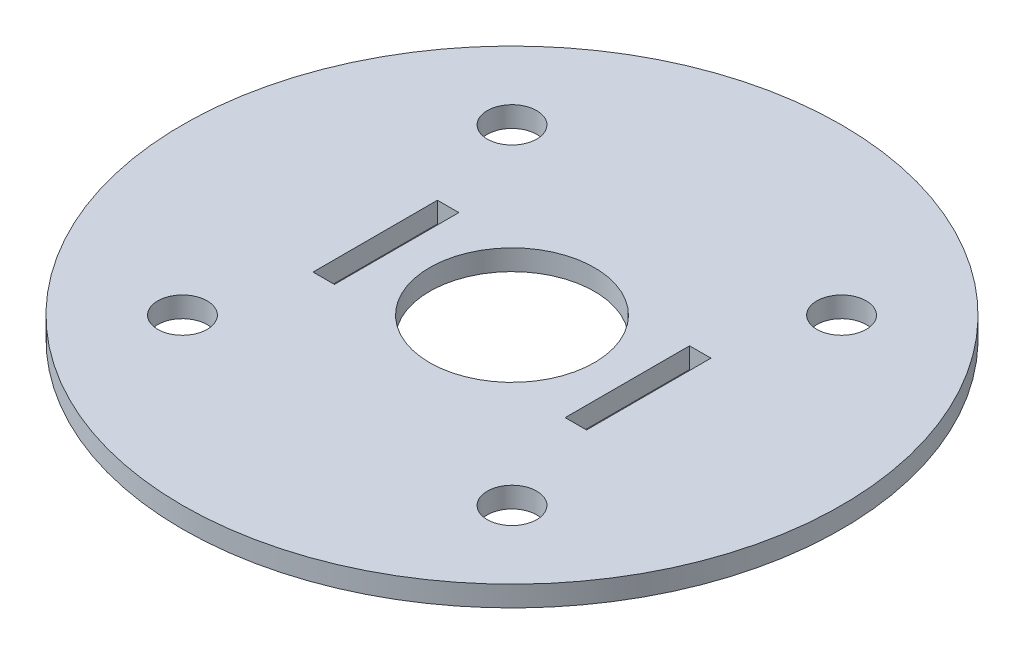
ISO-10303-21;
HEADER;
FILE_DESCRIPTION(('STEP AP214'),'2;1');
FILE_NAME('part.step','',(''),(''),'','','');
FILE_SCHEMA(('AUTOMOTIVE_DESIGN { 1 0 10303 214 1 1 1 1 }'));
ENDSEC;
DATA;
#1=APPLICATION_CONTEXT('core data for automotive mechanical design processes');
#2=APPLICATION_PROTOCOL_DEFINITION('international standard','automotive_design',2000,#1);
#3=PRODUCT_CONTEXT('',#1,'mechanical');
#4=PRODUCT('Part','Part','',(#3));
#5=PRODUCT_RELATED_PRODUCT_CATEGORY('part','',(#4));
#6=PRODUCT_DEFINITION_FORMATION('','',#4);
#7=PRODUCT_DEFINITION_CONTEXT('part definition',#1,'design');
#8=PRODUCT_DEFINITION('design','',#6,#7);
#9=PRODUCT_DEFINITION_SHAPE('','',#8);
#10=(LENGTH_UNIT() NAMED_UNIT(*) SI_UNIT(.MILLI.,.METRE.));
#11=(NAMED_UNIT(*) PLANE_ANGLE_UNIT() SI_UNIT($,.RADIAN.));
#12=(NAMED_UNIT(*) SI_UNIT($,.STERADIAN.) SOLID_ANGLE_UNIT());
#13=UNCERTAINTY_MEASURE_WITH_UNIT(LENGTH_MEASURE(1.E-05),#10,'distance_accuracy_value','');
#14=(GEOMETRIC_REPRESENTATION_CONTEXT(3) GLOBAL_UNCERTAINTY_ASSIGNED_CONTEXT((#13)) GLOBAL_UNIT_ASSIGNED_CONTEXT((#10,
#11,#12)) REPRESENTATION_CONTEXT('',''));
#15=CARTESIAN_POINT('',(0.,0.,0.));
#16=DIRECTION('',(0.,0.,1.));
#17=DIRECTION('',(1.,0.,0.));
#18=AXIS2_PLACEMENT_3D('',#15,#16,#17);
#19=CARTESIAN_POINT('',(0.,3.175,0.));
#20=DIRECTION('',(0.,1.,0.));
#21=DIRECTION('',(0.,0.,1.));
#22=AXIS2_PLACEMENT_3D('',#19,#20,#21);
#23=PLANE('',#22);
#24=DIRECTION('',(-1.,0.,0.));
#25=VECTOR('',#24,1.);
#26=CARTESIAN_POINT('',(21.082,3.175,-9.58850000000001));
#27=LINE('',#26,#25);
#28=CARTESIAN_POINT('',(21.082,3.175,-9.58850000000001));
#29=VERTEX_POINT('',#28);
#30=CARTESIAN_POINT('',(17.78,3.175,-9.58850000000001));
#31=VERTEX_POINT('',#30);
#32=EDGE_CURVE('E105',#29,#31,#27,.T.);
#33=ORIENTED_EDGE('',*,*,#32,.F.);
#34=DIRECTION('',(0.,0.,-1.));
#35=VECTOR('',#34,1.);
#36=CARTESIAN_POINT('',(21.082,3.175,-9.58850000000001));
#37=LINE('',#36,#35);
#38=CARTESIAN_POINT('',(21.082,3.175,9.5885));
#39=VERTEX_POINT('',#38);
#40=EDGE_CURVE('E97',#39,#29,#37,.T.);
#41=ORIENTED_EDGE('',*,*,#40,.F.);
#42=DIRECTION('',(1.,0.,0.));
#43=VECTOR('',#42,1.);
#44=CARTESIAN_POINT('',(21.082,3.175,9.5885));
#45=LINE('',#44,#43);
#46=CARTESIAN_POINT('',(17.78,3.175,9.5885));
#47=VERTEX_POINT('',#46);
#48=EDGE_CURVE('E120',#47,#39,#45,.T.);
#49=ORIENTED_EDGE('',*,*,#48,.F.);
#50=DIRECTION('',(0.,0.,1.));
#51=VECTOR('',#50,1.);
#52=CARTESIAN_POINT('',(17.78,3.175,-9.58850000000001));
#53=LINE('',#52,#51);
#54=EDGE_CURVE('E118',#31,#47,#53,.T.);
#55=ORIENTED_EDGE('',*,*,#54,.F.);
#56=EDGE_LOOP('',(#33,#41,#49,#55));
#57=FACE_BOUND('',#56,.T.);
#58=CARTESIAN_POINT('',(25.4,3.175,-25.4));
#59=DIRECTION('',(0.,1.,0.));
#60=DIRECTION('',(0.,0.,-1.));
#61=AXIS2_PLACEMENT_3D('',#58,#59,#60);
#62=CIRCLE('',#61,3.81);
#63=CARTESIAN_POINT('',(25.4,3.175,-29.21));
#64=VERTEX_POINT('',#63);
#65=EDGE_CURVE('E167',#64,#64,#62,.T.);
#66=ORIENTED_EDGE('',*,*,#65,.F.);
#67=EDGE_LOOP('',(#66));
#68=FACE_BOUND('',#67,.T.);
#69=CARTESIAN_POINT('',(-25.4,3.175,25.4));
#70=DIRECTION('',(0.,1.,0.));
#71=DIRECTION('',(0.,0.,-1.));
#72=AXIS2_PLACEMENT_3D('',#69,#70,#71);
#73=CIRCLE('',#72,3.81);
#74=CARTESIAN_POINT('',(-25.4,3.175,21.59));
#75=VERTEX_POINT('',#74);
#76=EDGE_CURVE('E179',#75,#75,#73,.T.);
#77=ORIENTED_EDGE('',*,*,#76,.F.);
#78=EDGE_LOOP('',(#77));
#79=FACE_BOUND('',#78,.T.);
#80=CARTESIAN_POINT('',(0.,3.175,0.));
#81=DIRECTION('',(0.,1.,0.));
#82=DIRECTION('',(0.,0.,1.));
#83=AXIS2_PLACEMENT_3D('',#80,#81,#82);
#84=CIRCLE('',#83,50.8);
#85=CARTESIAN_POINT('',(0.,3.175,50.8));
#86=VERTEX_POINT('',#85);
#87=EDGE_CURVE('E11',#86,#86,#84,.T.);
#88=ORIENTED_EDGE('',*,*,#87,.T.);
#89=EDGE_LOOP('',(#88));
#90=FACE_BOUND('',#89,.T.);
#91=CARTESIAN_POINT('',(-25.4,3.175,-25.4));
#92=DIRECTION('',(0.,1.,0.));
#93=DIRECTION('',(0.,0.,1.));
#94=AXIS2_PLACEMENT_3D('',#91,#92,#93);
#95=CIRCLE('',#94,3.81);
#96=CARTESIAN_POINT('',(-25.4,3.175,-21.59));
#97=VERTEX_POINT('',#96);
#98=EDGE_CURVE('E185',#97,#97,#95,.T.);
#99=ORIENTED_EDGE('',*,*,#98,.F.);
#100=EDGE_LOOP('',(#99));
#101=FACE_BOUND('',#100,.T.);
#102=CARTESIAN_POINT('',(25.4,3.175,25.4));
#103=DIRECTION('',(0.,1.,0.));
#104=DIRECTION('',(0.,0.,1.));
#105=AXIS2_PLACEMENT_3D('',#102,#103,#104);
#106=CIRCLE('',#105,3.81);
#107=CARTESIAN_POINT('',(25.4,3.175,29.21));
#108=VERTEX_POINT('',#107);
#109=EDGE_CURVE('E173',#108,#108,#106,.T.);
#110=ORIENTED_EDGE('',*,*,#109,.F.);
#111=EDGE_LOOP('',(#110));
#112=FACE_BOUND('',#111,.T.);
#113=DIRECTION('',(1.,0.,0.));
#114=VECTOR('',#113,1.);
#115=CARTESIAN_POINT('',(-21.082,3.175,9.5885));
#116=LINE('',#115,#114);
#117=CARTESIAN_POINT('',(-21.082,3.175,9.5885));
#118=VERTEX_POINT('',#117);
#119=CARTESIAN_POINT('',(-17.78,3.175,9.5885));
#120=VERTEX_POINT('',#119);
#121=EDGE_CURVE('E138',#118,#120,#116,.T.);
#122=ORIENTED_EDGE('',*,*,#121,.F.);
#123=DIRECTION('',(0.,0.,1.));
#124=VECTOR('',#123,1.);
#125=CARTESIAN_POINT('',(-21.082,3.175,-9.58850000000001));
#126=LINE('',#125,#124);
#127=CARTESIAN_POINT('',(-21.082,3.175,-9.58850000000001));
#128=VERTEX_POINT('',#127);
#129=EDGE_CURVE('E136',#128,#118,#126,.T.);
#130=ORIENTED_EDGE('',*,*,#129,.F.);
#131=DIRECTION('',(-1.,0.,0.));
#132=VECTOR('',#131,1.);
#133=CARTESIAN_POINT('',(-21.082,3.175,-9.58850000000001));
#134=LINE('',#133,#132);
#135=CARTESIAN_POINT('',(-17.78,3.175,-9.58850000000001));
#136=VERTEX_POINT('',#135);
#137=EDGE_CURVE('E144',#136,#128,#134,.T.);
#138=ORIENTED_EDGE('',*,*,#137,.F.);
#139=DIRECTION('',(0.,0.,-1.));
#140=VECTOR('',#139,1.);
#141=CARTESIAN_POINT('',(-17.78,3.175,-9.58850000000001));
#142=LINE('',#141,#140);
#143=EDGE_CURVE('E141',#120,#136,#142,.T.);
#144=ORIENTED_EDGE('',*,*,#143,.F.);
#145=EDGE_LOOP('',(#122,#130,#138,#144));
#146=FACE_BOUND('',#145,.T.);
#147=CARTESIAN_POINT('',(0.,3.175,0.));
#148=DIRECTION('',(0.,1.,0.));
#149=DIRECTION('',(0.,0.,1.));
#150=AXIS2_PLACEMENT_3D('',#147,#148,#149);
#151=CIRCLE('',#150,12.7);
#152=CARTESIAN_POINT('',(0.,3.175,12.7));
#153=VERTEX_POINT('',#152);
#154=EDGE_CURVE('E126',#153,#153,#151,.T.);
#155=ORIENTED_EDGE('',*,*,#154,.F.);
#156=EDGE_LOOP('',(#155));
#157=FACE_BOUND('',#156,.T.);
#158=ADVANCED_FACE('F32',(#57,#68,#79,#90,#101,#112,#146,#157),#23,.T.);
#159=CARTESIAN_POINT('',(0.,0.,0.));
#160=DIRECTION('',(0.,1.,0.));
#161=DIRECTION('',(0.,0.,1.));
#162=AXIS2_PLACEMENT_3D('',#159,#160,#161);
#163=PLANE('',#162);
#164=DIRECTION('',(0.,0.,-1.));
#165=VECTOR('',#164,1.);
#166=CARTESIAN_POINT('',(21.082,0.,-9.58850000000001));
#167=LINE('',#166,#165);
#168=CARTESIAN_POINT('',(21.082,0.,9.5885));
#169=VERTEX_POINT('',#168);
#170=CARTESIAN_POINT('',(21.082,0.,-9.58850000000001));
#171=VERTEX_POINT('',#170);
#172=EDGE_CURVE('E55',#169,#171,#167,.T.);
#173=ORIENTED_EDGE('',*,*,#172,.T.);
#174=DIRECTION('',(-1.,0.,0.));
#175=VECTOR('',#174,1.);
#176=CARTESIAN_POINT('',(21.082,0.,-9.58850000000001));
#177=LINE('',#176,#175);
#178=CARTESIAN_POINT('',(17.78,0.,-9.58850000000001));
#179=VERTEX_POINT('',#178);
#180=EDGE_CURVE('E112',#171,#179,#177,.T.);
#181=ORIENTED_EDGE('',*,*,#180,.T.);
#182=DIRECTION('',(0.,0.,1.));
#183=VECTOR('',#182,1.);
#184=CARTESIAN_POINT('',(17.78,0.,-9.58850000000001));
#185=LINE('',#184,#183);
#186=CARTESIAN_POINT('',(17.78,0.,9.5885));
#187=VERTEX_POINT('',#186);
#188=EDGE_CURVE('E128',#179,#187,#185,.T.);
#189=ORIENTED_EDGE('',*,*,#188,.T.);
#190=DIRECTION('',(1.,0.,0.));
#191=VECTOR('',#190,1.);
#192=CARTESIAN_POINT('',(21.082,0.,9.5885));
#193=LINE('',#192,#191);
#194=EDGE_CURVE('E106',#187,#169,#193,.T.);
#195=ORIENTED_EDGE('',*,*,#194,.T.);
#196=EDGE_LOOP('',(#173,#181,#189,#195));
#197=FACE_BOUND('',#196,.T.);
#198=CARTESIAN_POINT('',(25.4,0.,-25.4));
#199=DIRECTION('',(0.,1.,0.));
#200=DIRECTION('',(0.,0.,-1.));
#201=AXIS2_PLACEMENT_3D('',#198,#199,#200);
#202=CIRCLE('',#201,3.81);
#203=CARTESIAN_POINT('',(25.4,0.,-29.21));
#204=VERTEX_POINT('',#203);
#205=EDGE_CURVE('E166',#204,#204,#202,.T.);
#206=ORIENTED_EDGE('',*,*,#205,.T.);
#207=EDGE_LOOP('',(#206));
#208=FACE_BOUND('',#207,.T.);
#209=CARTESIAN_POINT('',(-25.4,0.,25.4));
#210=DIRECTION('',(0.,1.,0.));
#211=DIRECTION('',(0.,0.,-1.));
#212=AXIS2_PLACEMENT_3D('',#209,#210,#211);
#213=CIRCLE('',#212,3.81);
#214=CARTESIAN_POINT('',(-25.4,0.,21.59));
#215=VERTEX_POINT('',#214);
#216=EDGE_CURVE('E176',#215,#215,#213,.T.);
#217=ORIENTED_EDGE('',*,*,#216,.T.);
#218=EDGE_LOOP('',(#217));
#219=FACE_BOUND('',#218,.T.);
#220=CARTESIAN_POINT('',(0.,0.,0.));
#221=DIRECTION('',(0.,1.,0.));
#222=DIRECTION('',(0.,0.,1.));
#223=AXIS2_PLACEMENT_3D('',#220,#221,#222);
#224=CIRCLE('',#223,50.8);
#225=CARTESIAN_POINT('',(0.,0.,50.8));
#226=VERTEX_POINT('',#225);
#227=EDGE_CURVE('E36',#226,#226,#224,.T.);
#228=ORIENTED_EDGE('',*,*,#227,.F.);
#229=EDGE_LOOP('',(#228));
#230=FACE_BOUND('',#229,.T.);
#231=CARTESIAN_POINT('',(-25.4,0.,-25.4));
#232=DIRECTION('',(0.,1.,0.));
#233=DIRECTION('',(0.,0.,1.));
#234=AXIS2_PLACEMENT_3D('',#231,#232,#233);
#235=CIRCLE('',#234,3.81);
#236=CARTESIAN_POINT('',(-25.4,0.,-21.59));
#237=VERTEX_POINT('',#236);
#238=EDGE_CURVE('E182',#237,#237,#235,.T.);
#239=ORIENTED_EDGE('',*,*,#238,.T.);
#240=EDGE_LOOP('',(#239));
#241=FACE_BOUND('',#240,.T.);
#242=CARTESIAN_POINT('',(25.4,0.,25.4));
#243=DIRECTION('',(0.,1.,0.));
#244=DIRECTION('',(0.,0.,1.));
#245=AXIS2_PLACEMENT_3D('',#242,#243,#244);
#246=CIRCLE('',#245,3.81);
#247=CARTESIAN_POINT('',(25.4,0.,29.21));
#248=VERTEX_POINT('',#247);
#249=EDGE_CURVE('E170',#248,#248,#246,.T.);
#250=ORIENTED_EDGE('',*,*,#249,.T.);
#251=EDGE_LOOP('',(#250));
#252=FACE_BOUND('',#251,.T.);
#253=DIRECTION('',(0.,0.,1.));
#254=VECTOR('',#253,1.);
#255=CARTESIAN_POINT('',(-21.082,0.,-9.58850000000001));
#256=LINE('',#255,#254);
#257=CARTESIAN_POINT('',(-21.082,0.,-9.58850000000001));
#258=VERTEX_POINT('',#257);
#259=CARTESIAN_POINT('',(-21.082,0.,9.5885));
#260=VERTEX_POINT('',#259);
#261=EDGE_CURVE('E113',#258,#260,#256,.T.);
#262=ORIENTED_EDGE('',*,*,#261,.T.);
#263=DIRECTION('',(1.,0.,0.));
#264=VECTOR('',#263,1.);
#265=CARTESIAN_POINT('',(-21.082,0.,9.5885));
#266=LINE('',#265,#264);
#267=CARTESIAN_POINT('',(-17.78,0.,9.5885));
#268=VERTEX_POINT('',#267);
#269=EDGE_CURVE('E149',#260,#268,#266,.T.);
#270=ORIENTED_EDGE('',*,*,#269,.T.);
#271=DIRECTION('',(0.,0.,-1.));
#272=VECTOR('',#271,1.);
#273=CARTESIAN_POINT('',(-17.78,0.,-9.58850000000001));
#274=LINE('',#273,#272);
#275=CARTESIAN_POINT('',(-17.78,0.,-9.58850000000001));
#276=VERTEX_POINT('',#275);
#277=EDGE_CURVE('E152',#268,#276,#274,.T.);
#278=ORIENTED_EDGE('',*,*,#277,.T.);
#279=DIRECTION('',(-1.,0.,0.));
#280=VECTOR('',#279,1.);
#281=CARTESIAN_POINT('',(-21.082,0.,-9.58850000000001));
#282=LINE('',#281,#280);
#283=EDGE_CURVE('E139',#276,#258,#282,.T.);
#284=ORIENTED_EDGE('',*,*,#283,.T.);
#285=EDGE_LOOP('',(#262,#270,#278,#284));
#286=FACE_BOUND('',#285,.T.);
#287=CARTESIAN_POINT('',(0.,0.,0.));
#288=DIRECTION('',(0.,1.,0.));
#289=DIRECTION('',(0.,0.,1.));
#290=AXIS2_PLACEMENT_3D('',#287,#288,#289);
#291=CIRCLE('',#290,12.7);
#292=CARTESIAN_POINT('',(0.,0.,12.7));
#293=VERTEX_POINT('',#292);
#294=EDGE_CURVE('E272',#293,#293,#291,.T.);
#295=ORIENTED_EDGE('',*,*,#294,.T.);
#296=EDGE_LOOP('',(#295));
#297=FACE_BOUND('',#296,.T.);
#298=ADVANCED_FACE('F191',(#197,#208,#219,#230,#241,#252,#286,#297),#163,.F.);
#299=CARTESIAN_POINT('',(0.,3.175,0.));
#300=DIRECTION('',(0.,-1.,0.));
#301=DIRECTION('',(0.,0.,-1.));
#302=AXIS2_PLACEMENT_3D('',#299,#300,#301);
#303=CYLINDRICAL_SURFACE('',#302,50.8);
#304=ORIENTED_EDGE('',*,*,#87,.F.);
#305=EDGE_LOOP('',(#304));
#306=FACE_BOUND('',#305,.T.);
#307=ORIENTED_EDGE('',*,*,#227,.T.);
#308=EDGE_LOOP('',(#307));
#309=FACE_BOUND('',#308,.T.);
#310=ADVANCED_FACE('F34',(#306,#309),#303,.T.);
#311=CARTESIAN_POINT('',(-25.4,3.175,-25.4));
#312=DIRECTION('',(0.,-1.,0.));
#313=DIRECTION('',(0.,0.,-1.));
#314=AXIS2_PLACEMENT_3D('',#311,#312,#313);
#315=CYLINDRICAL_SURFACE('',#314,3.81);
#316=ORIENTED_EDGE('',*,*,#98,.T.);
#317=EDGE_LOOP('',(#316));
#318=FACE_BOUND('',#317,.T.);
#319=ORIENTED_EDGE('',*,*,#238,.F.);
#320=EDGE_LOOP('',(#319));
#321=FACE_BOUND('',#320,.T.);
#322=ADVANCED_FACE('F194',(#318,#321),#315,.F.);
#323=CARTESIAN_POINT('',(-25.4,3.175,25.4));
#324=DIRECTION('',(0.,-1.,0.));
#325=DIRECTION('',(0.,0.,-1.));
#326=AXIS2_PLACEMENT_3D('',#323,#324,#325);
#327=CYLINDRICAL_SURFACE('',#326,3.81);
#328=ORIENTED_EDGE('',*,*,#76,.T.);
#329=EDGE_LOOP('',(#328));
#330=FACE_BOUND('',#329,.T.);
#331=ORIENTED_EDGE('',*,*,#216,.F.);
#332=EDGE_LOOP('',(#331));
#333=FACE_BOUND('',#332,.T.);
#334=ADVANCED_FACE('F196',(#330,#333),#327,.F.);
#335=CARTESIAN_POINT('',(25.4,3.175,25.4));
#336=DIRECTION('',(0.,-1.,0.));
#337=DIRECTION('',(0.,0.,-1.));
#338=AXIS2_PLACEMENT_3D('',#335,#336,#337);
#339=CYLINDRICAL_SURFACE('',#338,3.81);
#340=ORIENTED_EDGE('',*,*,#109,.T.);
#341=EDGE_LOOP('',(#340));
#342=FACE_BOUND('',#341,.T.);
#343=ORIENTED_EDGE('',*,*,#249,.F.);
#344=EDGE_LOOP('',(#343));
#345=FACE_BOUND('',#344,.T.);
#346=ADVANCED_FACE('F203',(#342,#345),#339,.F.);
#347=CARTESIAN_POINT('',(25.4,3.175,-25.4));
#348=DIRECTION('',(0.,-1.,0.));
#349=DIRECTION('',(0.,0.,-1.));
#350=AXIS2_PLACEMENT_3D('',#347,#348,#349);
#351=CYLINDRICAL_SURFACE('',#350,3.81);
#352=ORIENTED_EDGE('',*,*,#65,.T.);
#353=EDGE_LOOP('',(#352));
#354=FACE_BOUND('',#353,.T.);
#355=ORIENTED_EDGE('',*,*,#205,.F.);
#356=EDGE_LOOP('',(#355));
#357=FACE_BOUND('',#356,.T.);
#358=ADVANCED_FACE('F225',(#354,#357),#351,.F.);
#359=CARTESIAN_POINT('',(-21.082,3.175,-9.58850000000001));
#360=DIRECTION('',(1.,0.,0.));
#361=DIRECTION('',(0.,0.,-1.));
#362=AXIS2_PLACEMENT_3D('',#359,#360,#361);
#363=PLANE('',#362);
#364=ORIENTED_EDGE('',*,*,#261,.F.);
#365=DIRECTION('',(0.,-1.,0.));
#366=VECTOR('',#365,1.);
#367=CARTESIAN_POINT('',(-21.082,3.175,-9.58850000000001));
#368=LINE('',#367,#366);
#369=EDGE_CURVE('E146',#128,#258,#368,.T.);
#370=ORIENTED_EDGE('',*,*,#369,.F.);
#371=ORIENTED_EDGE('',*,*,#129,.T.);
#372=DIRECTION('',(0.,-1.,0.));
#373=VECTOR('',#372,1.);
#374=CARTESIAN_POINT('',(-21.082,3.175,9.5885));
#375=LINE('',#374,#373);
#376=EDGE_CURVE('E163',#118,#260,#375,.T.);
#377=ORIENTED_EDGE('',*,*,#376,.T.);
#378=EDGE_LOOP('',(#364,#370,#371,#377));
#379=FACE_BOUND('',#378,.T.);
#380=ADVANCED_FACE('F227',(#379),#363,.T.);
#381=CARTESIAN_POINT('',(-21.082,3.175,9.5885));
#382=DIRECTION('',(0.,0.,-1.));
#383=DIRECTION('',(-1.,0.,0.));
#384=AXIS2_PLACEMENT_3D('',#381,#382,#383);
#385=PLANE('',#384);
#386=ORIENTED_EDGE('',*,*,#269,.F.);
#387=ORIENTED_EDGE('',*,*,#376,.F.);
#388=ORIENTED_EDGE('',*,*,#121,.T.);
#389=DIRECTION('',(0.,-1.,0.));
#390=VECTOR('',#389,1.);
#391=CARTESIAN_POINT('',(-17.78,3.175,9.5885));
#392=LINE('',#391,#390);
#393=EDGE_CURVE('E161',#120,#268,#392,.T.);
#394=ORIENTED_EDGE('',*,*,#393,.T.);
#395=EDGE_LOOP('',(#386,#387,#388,#394));
#396=FACE_BOUND('',#395,.T.);
#397=ADVANCED_FACE('F234',(#396),#385,.T.);
#398=CARTESIAN_POINT('',(-17.78,3.175,-9.58850000000001));
#399=DIRECTION('',(-1.,0.,0.));
#400=DIRECTION('',(0.,0.,1.));
#401=AXIS2_PLACEMENT_3D('',#398,#399,#400);
#402=PLANE('',#401);
#403=ORIENTED_EDGE('',*,*,#277,.F.);
#404=ORIENTED_EDGE('',*,*,#393,.F.);
#405=ORIENTED_EDGE('',*,*,#143,.T.);
#406=DIRECTION('',(0.,-1.,0.));
#407=VECTOR('',#406,1.);
#408=CARTESIAN_POINT('',(-17.78,3.175,-9.58850000000001));
#409=LINE('',#408,#407);
#410=EDGE_CURVE('E159',#136,#276,#409,.T.);
#411=ORIENTED_EDGE('',*,*,#410,.T.);
#412=EDGE_LOOP('',(#403,#404,#405,#411));
#413=FACE_BOUND('',#412,.T.);
#414=ADVANCED_FACE('F242',(#413),#402,.T.);
#415=CARTESIAN_POINT('',(-21.082,3.175,-9.58850000000001));
#416=DIRECTION('',(0.,0.,1.));
#417=DIRECTION('',(1.,0.,0.));
#418=AXIS2_PLACEMENT_3D('',#415,#416,#417);
#419=PLANE('',#418);
#420=ORIENTED_EDGE('',*,*,#283,.F.);
#421=ORIENTED_EDGE('',*,*,#410,.F.);
#422=ORIENTED_EDGE('',*,*,#137,.T.);
#423=ORIENTED_EDGE('',*,*,#369,.T.);
#424=EDGE_LOOP('',(#420,#421,#422,#423));
#425=FACE_BOUND('',#424,.T.);
#426=ADVANCED_FACE('F246',(#425),#419,.T.);
#427=CARTESIAN_POINT('',(21.082,3.175,-9.58850000000001));
#428=DIRECTION('',(-1.,0.,0.));
#429=DIRECTION('',(0.,0.,1.));
#430=AXIS2_PLACEMENT_3D('',#427,#428,#429);
#431=PLANE('',#430);
#432=ORIENTED_EDGE('',*,*,#172,.F.);
#433=DIRECTION('',(0.,-1.,0.));
#434=VECTOR('',#433,1.);
#435=CARTESIAN_POINT('',(21.082,3.175,9.5885));
#436=LINE('',#435,#434);
#437=EDGE_CURVE('E101',#39,#169,#436,.T.);
#438=ORIENTED_EDGE('',*,*,#437,.F.);
#439=ORIENTED_EDGE('',*,*,#40,.T.);
#440=DIRECTION('',(0.,-1.,0.));
#441=VECTOR('',#440,1.);
#442=CARTESIAN_POINT('',(21.082,3.175,-9.58850000000001));
#443=LINE('',#442,#441);
#444=EDGE_CURVE('E100',#29,#171,#443,.T.);
#445=ORIENTED_EDGE('',*,*,#444,.T.);
#446=EDGE_LOOP('',(#432,#438,#439,#445));
#447=FACE_BOUND('',#446,.T.);
#448=ADVANCED_FACE('F99',(#447),#431,.T.);
#449=CARTESIAN_POINT('',(21.082,3.175,-9.58850000000001));
#450=DIRECTION('',(0.,0.,1.));
#451=DIRECTION('',(1.,0.,0.));
#452=AXIS2_PLACEMENT_3D('',#449,#450,#451);
#453=PLANE('',#452);
#454=ORIENTED_EDGE('',*,*,#180,.F.);
#455=ORIENTED_EDGE('',*,*,#444,.F.);
#456=ORIENTED_EDGE('',*,*,#32,.T.);
#457=DIRECTION('',(0.,-1.,0.));
#458=VECTOR('',#457,1.);
#459=CARTESIAN_POINT('',(17.78,3.175,-9.58850000000001));
#460=LINE('',#459,#458);
#461=EDGE_CURVE('E114',#31,#179,#460,.T.);
#462=ORIENTED_EDGE('',*,*,#461,.T.);
#463=EDGE_LOOP('',(#454,#455,#456,#462));
#464=FACE_BOUND('',#463,.T.);
#465=ADVANCED_FACE('F109',(#464),#453,.T.);
#466=CARTESIAN_POINT('',(17.78,3.175,-9.58850000000001));
#467=DIRECTION('',(1.,0.,0.));
#468=DIRECTION('',(0.,0.,-1.));
#469=AXIS2_PLACEMENT_3D('',#466,#467,#468);
#470=PLANE('',#469);
#471=ORIENTED_EDGE('',*,*,#188,.F.);
#472=ORIENTED_EDGE('',*,*,#461,.F.);
#473=ORIENTED_EDGE('',*,*,#54,.T.);
#474=DIRECTION('',(0.,-1.,0.));
#475=VECTOR('',#474,1.);
#476=CARTESIAN_POINT('',(17.78,3.175,9.5885));
#477=LINE('',#476,#475);
#478=EDGE_CURVE('E47',#47,#187,#477,.T.);
#479=ORIENTED_EDGE('',*,*,#478,.T.);
#480=EDGE_LOOP('',(#471,#472,#473,#479));
#481=FACE_BOUND('',#480,.T.);
#482=ADVANCED_FACE('F255',(#481),#470,.T.);
#483=CARTESIAN_POINT('',(21.082,3.175,9.5885));
#484=DIRECTION('',(0.,0.,-1.));
#485=DIRECTION('',(-1.,0.,0.));
#486=AXIS2_PLACEMENT_3D('',#483,#484,#485);
#487=PLANE('',#486);
#488=ORIENTED_EDGE('',*,*,#194,.F.);
#489=ORIENTED_EDGE('',*,*,#478,.F.);
#490=ORIENTED_EDGE('',*,*,#48,.T.);
#491=ORIENTED_EDGE('',*,*,#437,.T.);
#492=EDGE_LOOP('',(#488,#489,#490,#491));
#493=FACE_BOUND('',#492,.T.);
#494=ADVANCED_FACE('F258',(#493),#487,.T.);
#495=CARTESIAN_POINT('',(0.,3.175,0.));
#496=DIRECTION('',(0.,-1.,0.));
#497=DIRECTION('',(0.,0.,-1.));
#498=AXIS2_PLACEMENT_3D('',#495,#496,#497);
#499=CYLINDRICAL_SURFACE('',#498,12.7);
#500=ORIENTED_EDGE('',*,*,#154,.T.);
#501=EDGE_LOOP('',(#500));
#502=FACE_BOUND('',#501,.T.);
#503=ORIENTED_EDGE('',*,*,#294,.F.);
#504=EDGE_LOOP('',(#503));
#505=FACE_BOUND('',#504,.T.);
#506=ADVANCED_FACE('F262',(#502,#505),#499,.F.);
#507=CLOSED_SHELL('',(#158,#298,#310,#322,#334,#346,#358,#380,#397,#414,#426,#448,#465,#482,
#494,#506));
#508=MANIFOLD_SOLID_BREP('B2',#507);
#509=ADVANCED_BREP_SHAPE_REPRESENTATION('',(#18,#508),#14);
#510=SHAPE_DEFINITION_REPRESENTATION(#9,#509);
ENDSEC;
END-ISO-10303-21;
